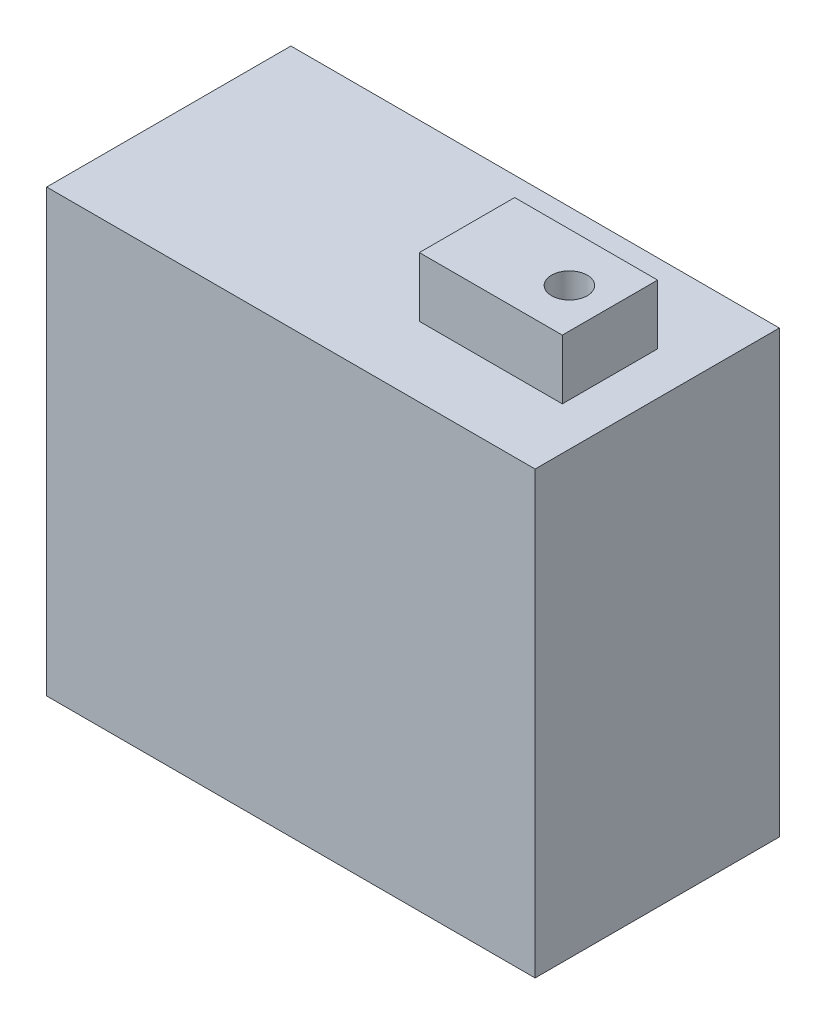
ISO-10303-21;
HEADER;
FILE_DESCRIPTION(('STEP AP214'),'2;1');
FILE_NAME('part.step','',(''),(''),'','','');
FILE_SCHEMA(('AUTOMOTIVE_DESIGN { 1 0 10303 214 1 1 1 1 }'));
ENDSEC;
DATA;
#1=APPLICATION_CONTEXT('core data for automotive mechanical design processes');
#2=APPLICATION_PROTOCOL_DEFINITION('international standard','automotive_design',2000,#1);
#3=PRODUCT_CONTEXT('',#1,'mechanical');
#4=PRODUCT('Part','Part','',(#3));
#5=PRODUCT_RELATED_PRODUCT_CATEGORY('part','',(#4));
#6=PRODUCT_DEFINITION_FORMATION('','',#4);
#7=PRODUCT_DEFINITION_CONTEXT('part definition',#1,'design');
#8=PRODUCT_DEFINITION('design','',#6,#7);
#9=PRODUCT_DEFINITION_SHAPE('','',#8);
#10=(LENGTH_UNIT() NAMED_UNIT(*) SI_UNIT(.MILLI.,.METRE.));
#11=(NAMED_UNIT(*) PLANE_ANGLE_UNIT() SI_UNIT($,.RADIAN.));
#12=(NAMED_UNIT(*) SI_UNIT($,.STERADIAN.) SOLID_ANGLE_UNIT());
#13=UNCERTAINTY_MEASURE_WITH_UNIT(LENGTH_MEASURE(1.E-05),#10,'distance_accuracy_value','');
#14=(GEOMETRIC_REPRESENTATION_CONTEXT(3) GLOBAL_UNCERTAINTY_ASSIGNED_CONTEXT((#13)) GLOBAL_UNIT_ASSIGNED_CONTEXT((#10,
#11,#12)) REPRESENTATION_CONTEXT('',''));
#15=CARTESIAN_POINT('',(0.,0.,0.));
#16=DIRECTION('',(0.,0.,1.));
#17=DIRECTION('',(1.,0.,0.));
#18=AXIS2_PLACEMENT_3D('',#15,#16,#17);
#19=CARTESIAN_POINT('',(0.,37.,0.));
#20=DIRECTION('',(0.,-1.,0.));
#21=DIRECTION('',(0.,0.,-1.));
#22=AXIS2_PLACEMENT_3D('',#19,#20,#21);
#23=PLANE('',#22);
#24=DIRECTION('',(0.,0.,1.));
#25=VECTOR('',#24,1.);
#26=CARTESIAN_POINT('',(0.,37.,0.));
#27=LINE('',#26,#25);
#28=CARTESIAN_POINT('',(0.,37.,-20.5));
#29=VERTEX_POINT('',#28);
#30=CARTESIAN_POINT('',(0.,37.,0.));
#31=VERTEX_POINT('',#30);
#32=EDGE_CURVE('E146',#29,#31,#27,.T.);
#33=ORIENTED_EDGE('',*,*,#32,.T.);
#34=DIRECTION('',(1.,0.,0.));
#35=VECTOR('',#34,1.);
#36=CARTESIAN_POINT('',(0.,37.,0.));
#37=LINE('',#36,#35);
#38=CARTESIAN_POINT('',(41.,37.,0.));
#39=VERTEX_POINT('',#38);
#40=EDGE_CURVE('E150',#31,#39,#37,.T.);
#41=ORIENTED_EDGE('',*,*,#40,.T.);
#42=DIRECTION('',(0.,0.,-1.));
#43=VECTOR('',#42,1.);
#44=CARTESIAN_POINT('',(41.,37.,0.));
#45=LINE('',#44,#43);
#46=CARTESIAN_POINT('',(41.,37.,-20.5));
#47=VERTEX_POINT('',#46);
#48=EDGE_CURVE('E154',#39,#47,#45,.T.);
#49=ORIENTED_EDGE('',*,*,#48,.T.);
#50=DIRECTION('',(-1.,0.,0.));
#51=VECTOR('',#50,1.);
#52=CARTESIAN_POINT('',(0.,37.,-20.5));
#53=LINE('',#52,#51);
#54=EDGE_CURVE('E157',#47,#29,#53,.T.);
#55=ORIENTED_EDGE('',*,*,#54,.T.);
#56=EDGE_LOOP('',(#33,#41,#49,#55));
#57=FACE_BOUND('',#56,.T.);
#58=DIRECTION('',(0.,0.,-1.));
#59=VECTOR('',#58,1.);
#60=CARTESIAN_POINT('',(37.4068060771713,37.,-5.87624936922671));
#61=LINE('',#60,#59);
#62=CARTESIAN_POINT('',(37.4068060771713,37.,-5.87624936922671));
#63=VERTEX_POINT('',#62);
#64=CARTESIAN_POINT('',(37.4068060771713,37.,-13.8762493692267));
#65=VERTEX_POINT('',#64);
#66=EDGE_CURVE('E133',#63,#65,#61,.T.);
#67=ORIENTED_EDGE('',*,*,#66,.F.);
#68=DIRECTION('',(1.,0.,0.));
#69=VECTOR('',#68,1.);
#70=CARTESIAN_POINT('',(25.4068060771713,37.,-5.87624936922671));
#71=LINE('',#70,#69);
#72=CARTESIAN_POINT('',(25.4068060771713,37.,-5.87624936922671));
#73=VERTEX_POINT('',#72);
#74=EDGE_CURVE('E130',#73,#63,#71,.T.);
#75=ORIENTED_EDGE('',*,*,#74,.F.);
#76=DIRECTION('',(0.,0.,1.));
#77=VECTOR('',#76,1.);
#78=CARTESIAN_POINT('',(25.4068060771713,37.,-5.87624936922671));
#79=LINE('',#78,#77);
#80=CARTESIAN_POINT('',(25.4068060771713,37.,-13.8762493692267));
#81=VERTEX_POINT('',#80);
#82=EDGE_CURVE('E66',#81,#73,#79,.T.);
#83=ORIENTED_EDGE('',*,*,#82,.F.);
#84=DIRECTION('',(-1.,0.,0.));
#85=VECTOR('',#84,1.);
#86=CARTESIAN_POINT('',(25.4068060771713,37.,-13.8762493692267));
#87=LINE('',#86,#85);
#88=EDGE_CURVE('E61',#65,#81,#87,.T.);
#89=ORIENTED_EDGE('',*,*,#88,.F.);
#90=EDGE_LOOP('',(#67,#75,#83,#89));
#91=FACE_BOUND('',#90,.T.);
#92=ADVANCED_FACE('F45',(#57,#91),#23,.F.);
#93=CARTESIAN_POINT('',(0.,37.,0.));
#94=DIRECTION('',(1.,0.,0.));
#95=DIRECTION('',(0.,0.,-1.));
#96=AXIS2_PLACEMENT_3D('',#93,#94,#95);
#97=PLANE('',#96);
#98=DIRECTION('',(0.,0.,1.));
#99=VECTOR('',#98,1.);
#100=CARTESIAN_POINT('',(0.,0.,0.));
#101=LINE('',#100,#99);
#102=CARTESIAN_POINT('',(0.,0.,-20.5));
#103=VERTEX_POINT('',#102);
#104=CARTESIAN_POINT('',(0.,0.,0.));
#105=VERTEX_POINT('',#104);
#106=EDGE_CURVE('E135',#103,#105,#101,.T.);
#107=ORIENTED_EDGE('',*,*,#106,.T.);
#108=DIRECTION('',(0.,-1.,0.));
#109=VECTOR('',#108,1.);
#110=CARTESIAN_POINT('',(0.,37.,0.));
#111=LINE('',#110,#109);
#112=EDGE_CURVE('E11',#31,#105,#111,.T.);
#113=ORIENTED_EDGE('',*,*,#112,.F.);
#114=ORIENTED_EDGE('',*,*,#32,.F.);
#115=DIRECTION('',(0.,-1.,0.));
#116=VECTOR('',#115,1.);
#117=CARTESIAN_POINT('',(0.,37.,-20.5));
#118=LINE('',#117,#116);
#119=EDGE_CURVE('E159',#29,#103,#118,.T.);
#120=ORIENTED_EDGE('',*,*,#119,.T.);
#121=EDGE_LOOP('',(#107,#113,#114,#120));
#122=FACE_BOUND('',#121,.T.);
#123=ADVANCED_FACE('F47',(#122),#97,.F.);
#124=CARTESIAN_POINT('',(0.,37.,0.));
#125=DIRECTION('',(0.,0.,-1.));
#126=DIRECTION('',(-1.,0.,0.));
#127=AXIS2_PLACEMENT_3D('',#124,#125,#126);
#128=PLANE('',#127);
#129=DIRECTION('',(1.,0.,0.));
#130=VECTOR('',#129,1.);
#131=CARTESIAN_POINT('',(0.,0.,0.));
#132=LINE('',#131,#130);
#133=CARTESIAN_POINT('',(41.,0.,0.));
#134=VERTEX_POINT('',#133);
#135=EDGE_CURVE('E140',#105,#134,#132,.T.);
#136=ORIENTED_EDGE('',*,*,#135,.T.);
#137=DIRECTION('',(0.,-1.,0.));
#138=VECTOR('',#137,1.);
#139=CARTESIAN_POINT('',(41.,37.,0.));
#140=LINE('',#139,#138);
#141=EDGE_CURVE('E54',#39,#134,#140,.T.);
#142=ORIENTED_EDGE('',*,*,#141,.F.);
#143=ORIENTED_EDGE('',*,*,#40,.F.);
#144=ORIENTED_EDGE('',*,*,#112,.T.);
#145=EDGE_LOOP('',(#136,#142,#143,#144));
#146=FACE_BOUND('',#145,.T.);
#147=ADVANCED_FACE('F195',(#146),#128,.F.);
#148=CARTESIAN_POINT('',(41.,37.,0.));
#149=DIRECTION('',(-1.,0.,0.));
#150=DIRECTION('',(0.,0.,1.));
#151=AXIS2_PLACEMENT_3D('',#148,#149,#150);
#152=PLANE('',#151);
#153=DIRECTION('',(0.,0.,-1.));
#154=VECTOR('',#153,1.);
#155=CARTESIAN_POINT('',(41.,0.,0.));
#156=LINE('',#155,#154);
#157=CARTESIAN_POINT('',(41.,0.,-20.5));
#158=VERTEX_POINT('',#157);
#159=EDGE_CURVE('E163',#134,#158,#156,.T.);
#160=ORIENTED_EDGE('',*,*,#159,.T.);
#161=DIRECTION('',(0.,-1.,0.));
#162=VECTOR('',#161,1.);
#163=CARTESIAN_POINT('',(41.,37.,-20.5));
#164=LINE('',#163,#162);
#165=EDGE_CURVE('E171',#47,#158,#164,.T.);
#166=ORIENTED_EDGE('',*,*,#165,.F.);
#167=ORIENTED_EDGE('',*,*,#48,.F.);
#168=ORIENTED_EDGE('',*,*,#141,.T.);
#169=EDGE_LOOP('',(#160,#166,#167,#168));
#170=FACE_BOUND('',#169,.T.);
#171=ADVANCED_FACE('F180',(#170),#152,.F.);
#172=CARTESIAN_POINT('',(0.,37.,-20.5));
#173=DIRECTION('',(0.,0.,1.));
#174=DIRECTION('',(1.,0.,0.));
#175=AXIS2_PLACEMENT_3D('',#172,#173,#174);
#176=PLANE('',#175);
#177=DIRECTION('',(-1.,0.,0.));
#178=VECTOR('',#177,1.);
#179=CARTESIAN_POINT('',(0.,0.,-20.5));
#180=LINE('',#179,#178);
#181=EDGE_CURVE('E151',#158,#103,#180,.T.);
#182=ORIENTED_EDGE('',*,*,#181,.T.);
#183=ORIENTED_EDGE('',*,*,#119,.F.);
#184=ORIENTED_EDGE('',*,*,#54,.F.);
#185=ORIENTED_EDGE('',*,*,#165,.T.);
#186=EDGE_LOOP('',(#182,#183,#184,#185));
#187=FACE_BOUND('',#186,.T.);
#188=ADVANCED_FACE('F189',(#187),#176,.F.);
#189=CARTESIAN_POINT('',(0.,0.,0.));
#190=DIRECTION('',(0.,-1.,0.));
#191=DIRECTION('',(0.,0.,-1.));
#192=AXIS2_PLACEMENT_3D('',#189,#190,#191);
#193=PLANE('',#192);
#194=ORIENTED_EDGE('',*,*,#106,.F.);
#195=ORIENTED_EDGE('',*,*,#181,.F.);
#196=ORIENTED_EDGE('',*,*,#159,.F.);
#197=ORIENTED_EDGE('',*,*,#135,.F.);
#198=EDGE_LOOP('',(#194,#195,#196,#197));
#199=FACE_BOUND('',#198,.T.);
#200=ADVANCED_FACE('F186',(#199),#193,.T.);
#201=CARTESIAN_POINT('',(37.4068060771713,42.,-5.87624936922671));
#202=DIRECTION('',(-1.,0.,0.));
#203=DIRECTION('',(0.,0.,1.));
#204=AXIS2_PLACEMENT_3D('',#201,#202,#203);
#205=PLANE('',#204);
#206=ORIENTED_EDGE('',*,*,#66,.T.);
#207=DIRECTION('',(0.,-1.,0.));
#208=VECTOR('',#207,1.);
#209=CARTESIAN_POINT('',(37.4068060771713,42.,-13.8762493692267));
#210=LINE('',#209,#208);
#211=CARTESIAN_POINT('',(37.4068060771713,42.,-13.8762493692267));
#212=VERTEX_POINT('',#211);
#213=EDGE_CURVE('E112',#212,#65,#210,.T.);
#214=ORIENTED_EDGE('',*,*,#213,.F.);
#215=DIRECTION('',(0.,0.,-1.));
#216=VECTOR('',#215,1.);
#217=CARTESIAN_POINT('',(37.4068060771713,42.,-5.87624936922671));
#218=LINE('',#217,#216);
#219=CARTESIAN_POINT('',(37.4068060771713,42.,-5.87624936922671));
#220=VERTEX_POINT('',#219);
#221=EDGE_CURVE('E120',#220,#212,#218,.T.);
#222=ORIENTED_EDGE('',*,*,#221,.F.);
#223=DIRECTION('',(0.,-1.,0.));
#224=VECTOR('',#223,1.);
#225=CARTESIAN_POINT('',(37.4068060771713,42.,-5.87624936922671));
#226=LINE('',#225,#224);
#227=EDGE_CURVE('E307',#220,#63,#226,.T.);
#228=ORIENTED_EDGE('',*,*,#227,.T.);
#229=EDGE_LOOP('',(#206,#214,#222,#228));
#230=FACE_BOUND('',#229,.T.);
#231=ADVANCED_FACE('F132',(#230),#205,.F.);
#232=CARTESIAN_POINT('',(25.4068060771713,42.,-13.8762493692267));
#233=DIRECTION('',(0.,0.,1.));
#234=DIRECTION('',(1.,0.,0.));
#235=AXIS2_PLACEMENT_3D('',#232,#233,#234);
#236=PLANE('',#235);
#237=ORIENTED_EDGE('',*,*,#88,.T.);
#238=DIRECTION('',(0.,-1.,0.));
#239=VECTOR('',#238,1.);
#240=CARTESIAN_POINT('',(25.4068060771713,42.,-13.8762493692267));
#241=LINE('',#240,#239);
#242=CARTESIAN_POINT('',(25.4068060771713,42.,-13.8762493692267));
#243=VERTEX_POINT('',#242);
#244=EDGE_CURVE('E115',#243,#81,#241,.T.);
#245=ORIENTED_EDGE('',*,*,#244,.F.);
#246=DIRECTION('',(-1.,0.,0.));
#247=VECTOR('',#246,1.);
#248=CARTESIAN_POINT('',(25.4068060771713,42.,-13.8762493692267));
#249=LINE('',#248,#247);
#250=EDGE_CURVE('E108',#212,#243,#249,.T.);
#251=ORIENTED_EDGE('',*,*,#250,.F.);
#252=ORIENTED_EDGE('',*,*,#213,.T.);
#253=EDGE_LOOP('',(#237,#245,#251,#252));
#254=FACE_BOUND('',#253,.T.);
#255=ADVANCED_FACE('F110',(#254),#236,.F.);
#256=CARTESIAN_POINT('',(25.4068060771713,42.,-5.87624936922671));
#257=DIRECTION('',(1.,0.,0.));
#258=DIRECTION('',(0.,0.,-1.));
#259=AXIS2_PLACEMENT_3D('',#256,#257,#258);
#260=PLANE('',#259);
#261=ORIENTED_EDGE('',*,*,#82,.T.);
#262=DIRECTION('',(0.,-1.,0.));
#263=VECTOR('',#262,1.);
#264=CARTESIAN_POINT('',(25.4068060771713,42.,-5.87624936922671));
#265=LINE('',#264,#263);
#266=CARTESIAN_POINT('',(25.4068060771713,42.,-5.87624936922671));
#267=VERTEX_POINT('',#266);
#268=EDGE_CURVE('E142',#267,#73,#265,.T.);
#269=ORIENTED_EDGE('',*,*,#268,.F.);
#270=DIRECTION('',(0.,0.,1.));
#271=VECTOR('',#270,1.);
#272=CARTESIAN_POINT('',(25.4068060771713,42.,-5.87624936922671));
#273=LINE('',#272,#271);
#274=EDGE_CURVE('E119',#243,#267,#273,.T.);
#275=ORIENTED_EDGE('',*,*,#274,.F.);
#276=ORIENTED_EDGE('',*,*,#244,.T.);
#277=EDGE_LOOP('',(#261,#269,#275,#276));
#278=FACE_BOUND('',#277,.T.);
#279=ADVANCED_FACE('F242',(#278),#260,.F.);
#280=CARTESIAN_POINT('',(25.4068060771713,42.,-5.87624936922671));
#281=DIRECTION('',(0.,0.,-1.));
#282=DIRECTION('',(-1.,0.,0.));
#283=AXIS2_PLACEMENT_3D('',#280,#281,#282);
#284=PLANE('',#283);
#285=ORIENTED_EDGE('',*,*,#74,.T.);
#286=ORIENTED_EDGE('',*,*,#227,.F.);
#287=DIRECTION('',(1.,0.,0.));
#288=VECTOR('',#287,1.);
#289=CARTESIAN_POINT('',(25.4068060771713,42.,-5.87624936922671));
#290=LINE('',#289,#288);
#291=EDGE_CURVE('E125',#267,#220,#290,.T.);
#292=ORIENTED_EDGE('',*,*,#291,.F.);
#293=ORIENTED_EDGE('',*,*,#268,.T.);
#294=EDGE_LOOP('',(#285,#286,#292,#293));
#295=FACE_BOUND('',#294,.T.);
#296=ADVANCED_FACE('F250',(#295),#284,.F.);
#297=CARTESIAN_POINT('',(0.,42.,0.));
#298=DIRECTION('',(0.,-1.,0.));
#299=DIRECTION('',(0.,0.,-1.));
#300=AXIS2_PLACEMENT_3D('',#297,#298,#299);
#301=PLANE('',#300);
#302=CARTESIAN_POINT('',(34.0954431796746,42.,-9.78325503168384));
#303=DIRECTION('',(0.,1.,0.));
#304=DIRECTION('',(0.,0.,1.));
#305=AXIS2_PLACEMENT_3D('',#302,#303,#304);
#306=CIRCLE('',#305,1.5);
#307=CARTESIAN_POINT('',(34.0954431796746,42.,-8.28325503168383));
#308=VERTEX_POINT('',#307);
#309=EDGE_CURVE('E296',#308,#308,#306,.T.);
#310=ORIENTED_EDGE('',*,*,#309,.F.);
#311=EDGE_LOOP('',(#310));
#312=FACE_BOUND('',#311,.T.);
#313=ORIENTED_EDGE('',*,*,#221,.T.);
#314=ORIENTED_EDGE('',*,*,#250,.T.);
#315=ORIENTED_EDGE('',*,*,#274,.T.);
#316=ORIENTED_EDGE('',*,*,#291,.T.);
#317=EDGE_LOOP('',(#313,#314,#315,#316));
#318=FACE_BOUND('',#317,.T.);
#319=ADVANCED_FACE('F123',(#312,#318),#301,.F.);
#320=CARTESIAN_POINT('',(34.0954431796746,12.,-9.78325503168384));
#321=DIRECTION('',(0.,1.,0.));
#322=DIRECTION('',(0.,0.,1.));
#323=AXIS2_PLACEMENT_3D('',#320,#321,#322);
#324=CYLINDRICAL_SURFACE('',#323,1.5);
#325=CARTESIAN_POINT('',(34.0954431796746,12.,-9.78325503168384));
#326=DIRECTION('',(0.,1.,0.));
#327=DIRECTION('',(0.,0.,1.));
#328=AXIS2_PLACEMENT_3D('',#325,#326,#327);
#329=CIRCLE('',#328,1.5);
#330=CARTESIAN_POINT('',(34.0954431796746,12.,-8.28325503168383));
#331=VERTEX_POINT('',#330);
#332=EDGE_CURVE('E294',#331,#331,#329,.T.);
#333=ORIENTED_EDGE('',*,*,#332,.F.);
#334=EDGE_LOOP('',(#333));
#335=FACE_BOUND('',#334,.T.);
#336=ORIENTED_EDGE('',*,*,#309,.T.);
#337=EDGE_LOOP('',(#336));
#338=FACE_BOUND('',#337,.T.);
#339=ADVANCED_FACE('F269',(#335,#338),#324,.F.);
#340=CARTESIAN_POINT('',(34.0954431796746,12.,-9.78325503168384));
#341=DIRECTION('',(0.,1.,0.));
#342=DIRECTION('',(0.,0.,1.));
#343=AXIS2_PLACEMENT_3D('',#340,#341,#342);
#344=PLANE('',#343);
#345=ORIENTED_EDGE('',*,*,#332,.T.);
#346=EDGE_LOOP('',(#345));
#347=FACE_BOUND('',#346,.T.);
#348=ADVANCED_FACE('F279',(#347),#344,.T.);
#349=CLOSED_SHELL('',(#92,#123,#147,#171,#188,#200,#231,#255,#279,#296,#319,#339,#348));
#350=MANIFOLD_SOLID_BREP('B2',#349);
#351=ADVANCED_BREP_SHAPE_REPRESENTATION('',(#18,#350),#14);
#352=SHAPE_DEFINITION_REPRESENTATION(#9,#351);
ENDSEC;
END-ISO-10303-21;
